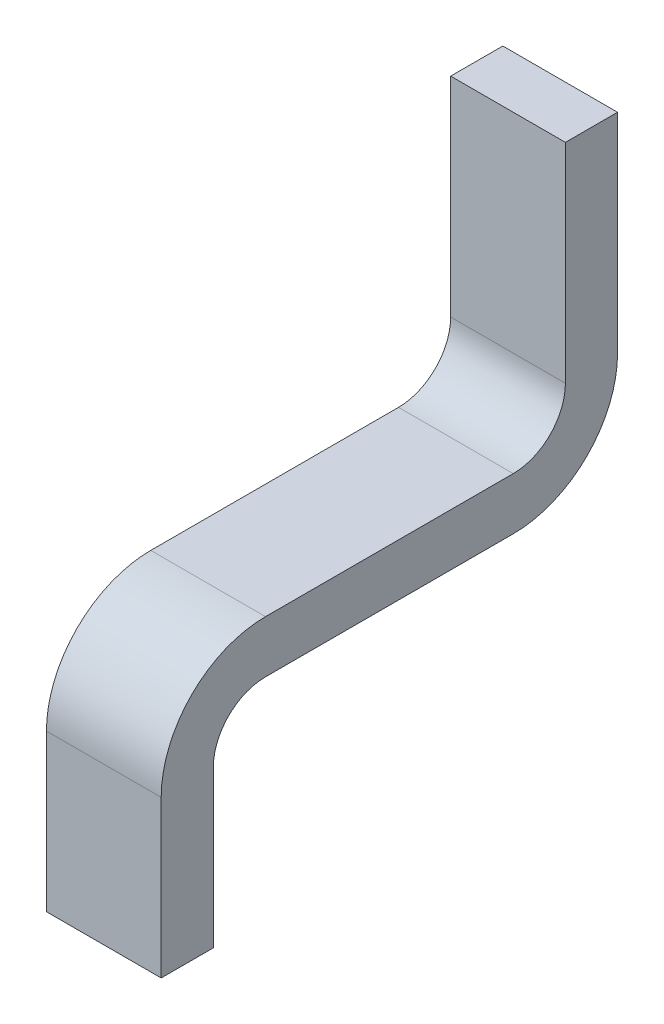
ISO-10303-21;
HEADER;
FILE_DESCRIPTION(('STEP AP214'),'2;1');
FILE_NAME('part.step','',(''),(''),'','','');
FILE_SCHEMA(('AUTOMOTIVE_DESIGN { 1 0 10303 214 1 1 1 1 }'));
ENDSEC;
DATA;
#1=APPLICATION_CONTEXT('core data for automotive mechanical design processes');
#2=APPLICATION_PROTOCOL_DEFINITION('international standard','automotive_design',2000,#1);
#3=PRODUCT_CONTEXT('',#1,'mechanical');
#4=PRODUCT('Part','Part','',(#3));
#5=PRODUCT_RELATED_PRODUCT_CATEGORY('part','',(#4));
#6=PRODUCT_DEFINITION_FORMATION('','',#4);
#7=PRODUCT_DEFINITION_CONTEXT('part definition',#1,'design');
#8=PRODUCT_DEFINITION('design','',#6,#7);
#9=PRODUCT_DEFINITION_SHAPE('','',#8);
#10=(LENGTH_UNIT() NAMED_UNIT(*) SI_UNIT(.MILLI.,.METRE.));
#11=(NAMED_UNIT(*) PLANE_ANGLE_UNIT() SI_UNIT($,.RADIAN.));
#12=(NAMED_UNIT(*) SI_UNIT($,.STERADIAN.) SOLID_ANGLE_UNIT());
#13=UNCERTAINTY_MEASURE_WITH_UNIT(LENGTH_MEASURE(1.E-05),#10,'distance_accuracy_value','');
#14=(GEOMETRIC_REPRESENTATION_CONTEXT(3) GLOBAL_UNCERTAINTY_ASSIGNED_CONTEXT((#13)) GLOBAL_UNIT_ASSIGNED_CONTEXT((#10,
#11,#12)) REPRESENTATION_CONTEXT('',''));
#15=CARTESIAN_POINT('',(0.,0.,0.));
#16=DIRECTION('',(0.,0.,1.));
#17=DIRECTION('',(1.,0.,0.));
#18=AXIS2_PLACEMENT_3D('',#15,#16,#17);
#19=CARTESIAN_POINT('',(-2.64,4.,0.675));
#20=DIRECTION('',(-1.,0.,0.));
#21=DIRECTION('',(0.,-1.,0.));
#22=AXIS2_PLACEMENT_3D('',#19,#20,#21);
#23=PLANE('',#22);
#24=CARTESIAN_POINT('',(-2.64000000000001,3.80000000000001,0.675));
#25=DIRECTION('',(1.,0.,0.));
#26=DIRECTION('',(0.,1.,0.));
#27=AXIS2_PLACEMENT_3D('',#24,#25,#26);
#28=CIRCLE('',#27,0.2);
#29=CARTESIAN_POINT('',(-2.64000000000001,3.80000000000001,0.875));
#30=VERTEX_POINT('',#29);
#31=CARTESIAN_POINT('',(-2.64,4.,0.675));
#32=VERTEX_POINT('',#31);
#33=EDGE_CURVE('E150',#30,#32,#28,.F.);
#34=ORIENTED_EDGE('',*,*,#33,.F.);
#35=DIRECTION('',(0.,1.,0.));
#36=VECTOR('',#35,1.);
#37=CARTESIAN_POINT('',(-2.64,3.5,0.875));
#38=LINE('',#37,#36);
#39=CARTESIAN_POINT('',(-2.64,3.5,0.875));
#40=VERTEX_POINT('',#39);
#41=EDGE_CURVE('E147',#30,#40,#38,.F.);
#42=ORIENTED_EDGE('',*,*,#41,.T.);
#43=DIRECTION('',(0.,0.,1.));
#44=VECTOR('',#43,1.);
#45=CARTESIAN_POINT('',(-2.64,3.5,0.775));
#46=LINE('',#45,#44);
#47=CARTESIAN_POINT('',(-2.64,3.5,0.775));
#48=VERTEX_POINT('',#47);
#49=EDGE_CURVE('E141',#48,#40,#46,.T.);
#50=ORIENTED_EDGE('',*,*,#49,.F.);
#51=DIRECTION('',(0.,1.,0.));
#52=VECTOR('',#51,1.);
#53=CARTESIAN_POINT('',(-2.64,3.5,0.775));
#54=LINE('',#53,#52);
#55=CARTESIAN_POINT('',(-2.64000000000001,3.80000000000001,0.775));
#56=VERTEX_POINT('',#55);
#57=EDGE_CURVE('E115',#48,#56,#54,.T.);
#58=ORIENTED_EDGE('',*,*,#57,.T.);
#59=CARTESIAN_POINT('',(-2.64000000000001,3.80000000000001,0.675));
#60=DIRECTION('',(1.,0.,0.));
#61=DIRECTION('',(0.,1.,0.));
#62=AXIS2_PLACEMENT_3D('',#59,#60,#61);
#63=CIRCLE('',#62,0.1);
#64=CARTESIAN_POINT('',(-2.64,3.9,0.675));
#65=VERTEX_POINT('',#64);
#66=EDGE_CURVE('E215',#56,#65,#63,.F.);
#67=ORIENTED_EDGE('',*,*,#66,.T.);
#68=DIRECTION('',(0.,0.,1.));
#69=VECTOR('',#68,1.);
#70=CARTESIAN_POINT('',(-2.64,3.9,0.675));
#71=LINE('',#70,#69);
#72=CARTESIAN_POINT('',(-2.64,3.9,0.2));
#73=VERTEX_POINT('',#72);
#74=EDGE_CURVE('E181',#65,#73,#71,.F.);
#75=ORIENTED_EDGE('',*,*,#74,.T.);
#76=CARTESIAN_POINT('',(-2.64,4.1,0.2));
#77=DIRECTION('',(-1.,0.,0.));
#78=DIRECTION('',(0.,-1.,0.));
#79=AXIS2_PLACEMENT_3D('',#76,#77,#78);
#80=CIRCLE('',#79,0.2);
#81=CARTESIAN_POINT('',(-2.64,4.1,0.));
#82=VERTEX_POINT('',#81);
#83=EDGE_CURVE('E20',#82,#73,#80,.T.);
#84=ORIENTED_EDGE('',*,*,#83,.F.);
#85=DIRECTION('',(0.,1.,0.));
#86=VECTOR('',#85,1.);
#87=CARTESIAN_POINT('',(-2.64,4.1,0.));
#88=LINE('',#87,#86);
#89=CARTESIAN_POINT('',(-2.64,4.5,0.));
#90=VERTEX_POINT('',#89);
#91=EDGE_CURVE('E91',#82,#90,#88,.T.);
#92=ORIENTED_EDGE('',*,*,#91,.T.);
#93=DIRECTION('',(0.,0.,1.));
#94=VECTOR('',#93,1.);
#95=CARTESIAN_POINT('',(-2.64,4.5,0.));
#96=LINE('',#95,#94);
#97=CARTESIAN_POINT('',(-2.64,4.5,0.1));
#98=VERTEX_POINT('',#97);
#99=EDGE_CURVE('E163',#90,#98,#96,.T.);
#100=ORIENTED_EDGE('',*,*,#99,.T.);
#101=DIRECTION('',(0.,1.,0.));
#102=VECTOR('',#101,1.);
#103=CARTESIAN_POINT('',(-2.64,4.1,0.1));
#104=LINE('',#103,#102);
#105=CARTESIAN_POINT('',(-2.64,4.1,0.1));
#106=VERTEX_POINT('',#105);
#107=EDGE_CURVE('E159',#98,#106,#104,.F.);
#108=ORIENTED_EDGE('',*,*,#107,.T.);
#109=CARTESIAN_POINT('',(-2.64,4.1,0.2));
#110=DIRECTION('',(-1.,0.,0.));
#111=DIRECTION('',(0.,-1.,0.));
#112=AXIS2_PLACEMENT_3D('',#109,#110,#111);
#113=CIRCLE('',#112,0.1);
#114=CARTESIAN_POINT('',(-2.64,4.,0.2));
#115=VERTEX_POINT('',#114);
#116=EDGE_CURVE('E155',#106,#115,#113,.T.);
#117=ORIENTED_EDGE('',*,*,#116,.T.);
#118=DIRECTION('',(0.,0.,1.));
#119=VECTOR('',#118,1.);
#120=CARTESIAN_POINT('',(-2.64,4.,0.675));
#121=LINE('',#120,#119);
#122=EDGE_CURVE('E154',#115,#32,#121,.T.);
#123=ORIENTED_EDGE('',*,*,#122,.T.);
#124=EDGE_LOOP('',(#34,#42,#50,#58,#67,#75,#84,#92,#100,#108,#117,#123));
#125=FACE_BOUND('',#124,.T.);
#126=ADVANCED_FACE('F17',(#125),#23,.F.);
#127=CARTESIAN_POINT('',(-2.64,4.1,0.2));
#128=DIRECTION('',(-1.,0.,0.));
#129=DIRECTION('',(0.,-1.,0.));
#130=AXIS2_PLACEMENT_3D('',#127,#128,#129);
#131=CYLINDRICAL_SURFACE('',#130,0.2);
#132=CARTESIAN_POINT('',(-2.86,4.1,0.2));
#133=DIRECTION('',(-1.,0.,0.));
#134=DIRECTION('',(0.,-1.,0.));
#135=AXIS2_PLACEMENT_3D('',#132,#133,#134);
#136=CIRCLE('',#135,0.2);
#137=CARTESIAN_POINT('',(-2.86,3.9,0.2));
#138=VERTEX_POINT('',#137);
#139=CARTESIAN_POINT('',(-2.86,4.1,0.));
#140=VERTEX_POINT('',#139);
#141=EDGE_CURVE('E183',#138,#140,#136,.F.);
#142=ORIENTED_EDGE('',*,*,#141,.T.);
#143=DIRECTION('',(1.,0.,0.));
#144=VECTOR('',#143,1.);
#145=CARTESIAN_POINT('',(-2.64,4.1,0.));
#146=LINE('',#145,#144);
#147=EDGE_CURVE('E178',#140,#82,#146,.T.);
#148=ORIENTED_EDGE('',*,*,#147,.T.);
#149=ORIENTED_EDGE('',*,*,#83,.T.);
#150=DIRECTION('',(-1.,0.,0.));
#151=VECTOR('',#150,1.);
#152=CARTESIAN_POINT('',(-2.64,3.9,0.2));
#153=LINE('',#152,#151);
#154=EDGE_CURVE('E217',#73,#138,#153,.T.);
#155=ORIENTED_EDGE('',*,*,#154,.T.);
#156=EDGE_LOOP('',(#142,#148,#149,#155));
#157=FACE_BOUND('',#156,.T.);
#158=ADVANCED_FACE('F254',(#157),#131,.T.);
#159=CARTESIAN_POINT('',(-2.64,4.1,0.));
#160=DIRECTION('',(0.,0.,1.));
#161=DIRECTION('',(1.,0.,0.));
#162=AXIS2_PLACEMENT_3D('',#159,#160,#161);
#163=PLANE('',#162);
#164=ORIENTED_EDGE('',*,*,#147,.F.);
#165=DIRECTION('',(0.,1.,0.));
#166=VECTOR('',#165,1.);
#167=CARTESIAN_POINT('',(-2.86,3.9,0.));
#168=LINE('',#167,#166);
#169=CARTESIAN_POINT('',(-2.86,4.5,0.));
#170=VERTEX_POINT('',#169);
#171=EDGE_CURVE('E170',#140,#170,#168,.T.);
#172=ORIENTED_EDGE('',*,*,#171,.T.);
#173=DIRECTION('',(1.,0.,0.));
#174=VECTOR('',#173,1.);
#175=CARTESIAN_POINT('',(-2.64,4.5,0.));
#176=LINE('',#175,#174);
#177=EDGE_CURVE('E173',#170,#90,#176,.T.);
#178=ORIENTED_EDGE('',*,*,#177,.T.);
#179=ORIENTED_EDGE('',*,*,#91,.F.);
#180=EDGE_LOOP('',(#164,#172,#178,#179));
#181=FACE_BOUND('',#180,.T.);
#182=ADVANCED_FACE('F257',(#181),#163,.F.);
#183=CARTESIAN_POINT('',(-2.64,4.5,0.));
#184=DIRECTION('',(0.,-1.,0.));
#185=DIRECTION('',(1.,0.,0.));
#186=AXIS2_PLACEMENT_3D('',#183,#184,#185);
#187=PLANE('',#186);
#188=DIRECTION('',(-1.,0.,0.));
#189=VECTOR('',#188,1.);
#190=CARTESIAN_POINT('',(-2.86,4.5,0.1));
#191=LINE('',#190,#189);
#192=CARTESIAN_POINT('',(-2.86,4.5,0.1));
#193=VERTEX_POINT('',#192);
#194=EDGE_CURVE('E160',#193,#98,#191,.F.);
#195=ORIENTED_EDGE('',*,*,#194,.T.);
#196=ORIENTED_EDGE('',*,*,#99,.F.);
#197=ORIENTED_EDGE('',*,*,#177,.F.);
#198=DIRECTION('',(0.,0.,1.));
#199=VECTOR('',#198,1.);
#200=CARTESIAN_POINT('',(-2.86,4.5,0.675));
#201=LINE('',#200,#199);
#202=EDGE_CURVE('E166',#170,#193,#201,.T.);
#203=ORIENTED_EDGE('',*,*,#202,.T.);
#204=EDGE_LOOP('',(#195,#196,#197,#203));
#205=FACE_BOUND('',#204,.T.);
#206=ADVANCED_FACE('F259',(#205),#187,.F.);
#207=CARTESIAN_POINT('',(-2.86,4.1,0.1));
#208=DIRECTION('',(0.,0.,-1.));
#209=DIRECTION('',(-1.,0.,0.));
#210=AXIS2_PLACEMENT_3D('',#207,#208,#209);
#211=PLANE('',#210);
#212=DIRECTION('',(-1.,0.,0.));
#213=VECTOR('',#212,1.);
#214=CARTESIAN_POINT('',(-2.86,4.1,0.1));
#215=LINE('',#214,#213);
#216=CARTESIAN_POINT('',(-2.86,4.1,0.1));
#217=VERTEX_POINT('',#216);
#218=EDGE_CURVE('E156',#217,#106,#215,.F.);
#219=ORIENTED_EDGE('',*,*,#218,.T.);
#220=ORIENTED_EDGE('',*,*,#107,.F.);
#221=ORIENTED_EDGE('',*,*,#194,.F.);
#222=DIRECTION('',(0.,1.,0.));
#223=VECTOR('',#222,1.);
#224=CARTESIAN_POINT('',(-2.86,3.9,0.1));
#225=LINE('',#224,#223);
#226=EDGE_CURVE('E169',#193,#217,#225,.F.);
#227=ORIENTED_EDGE('',*,*,#226,.T.);
#228=EDGE_LOOP('',(#219,#220,#221,#227));
#229=FACE_BOUND('',#228,.T.);
#230=ADVANCED_FACE('F234',(#229),#211,.F.);
#231=CARTESIAN_POINT('',(-2.86,4.1,0.2));
#232=DIRECTION('',(-1.,0.,0.));
#233=DIRECTION('',(0.,-1.,0.));
#234=AXIS2_PLACEMENT_3D('',#231,#232,#233);
#235=CYLINDRICAL_SURFACE('',#234,0.1);
#236=DIRECTION('',(1.,0.,0.));
#237=VECTOR('',#236,1.);
#238=CARTESIAN_POINT('',(-2.86,4.,0.2));
#239=LINE('',#238,#237);
#240=CARTESIAN_POINT('',(-2.86,4.,0.2));
#241=VERTEX_POINT('',#240);
#242=EDGE_CURVE('E151',#241,#115,#239,.T.);
#243=ORIENTED_EDGE('',*,*,#242,.T.);
#244=ORIENTED_EDGE('',*,*,#116,.F.);
#245=ORIENTED_EDGE('',*,*,#218,.F.);
#246=CARTESIAN_POINT('',(-2.86,4.1,0.2));
#247=DIRECTION('',(-1.,0.,0.));
#248=DIRECTION('',(0.,-1.,0.));
#249=AXIS2_PLACEMENT_3D('',#246,#247,#248);
#250=CIRCLE('',#249,0.1);
#251=EDGE_CURVE('E210',#217,#241,#250,.T.);
#252=ORIENTED_EDGE('',*,*,#251,.T.);
#253=EDGE_LOOP('',(#243,#244,#245,#252));
#254=FACE_BOUND('',#253,.T.);
#255=ADVANCED_FACE('F227',(#254),#235,.F.);
#256=CARTESIAN_POINT('',(-2.86,4.,0.675));
#257=DIRECTION('',(0.,-1.,0.));
#258=DIRECTION('',(1.,0.,0.));
#259=AXIS2_PLACEMENT_3D('',#256,#257,#258);
#260=PLANE('',#259);
#261=DIRECTION('',(1.,0.,0.));
#262=VECTOR('',#261,1.);
#263=CARTESIAN_POINT('',(-2.86,4.,0.675));
#264=LINE('',#263,#262);
#265=CARTESIAN_POINT('',(-2.86,4.,0.675));
#266=VERTEX_POINT('',#265);
#267=EDGE_CURVE('E148',#32,#266,#264,.F.);
#268=ORIENTED_EDGE('',*,*,#267,.F.);
#269=ORIENTED_EDGE('',*,*,#122,.F.);
#270=ORIENTED_EDGE('',*,*,#242,.F.);
#271=DIRECTION('',(0.,0.,1.));
#272=VECTOR('',#271,1.);
#273=CARTESIAN_POINT('',(-2.86,4.,0.675));
#274=LINE('',#273,#272);
#275=EDGE_CURVE('E209',#241,#266,#274,.T.);
#276=ORIENTED_EDGE('',*,*,#275,.T.);
#277=EDGE_LOOP('',(#268,#269,#270,#276));
#278=FACE_BOUND('',#277,.T.);
#279=ADVANCED_FACE('F224',(#278),#260,.F.);
#280=CARTESIAN_POINT('',(-2.86,3.8,0.675));
#281=DIRECTION('',(1.,0.,0.));
#282=DIRECTION('',(0.,1.,0.));
#283=AXIS2_PLACEMENT_3D('',#280,#281,#282);
#284=CYLINDRICAL_SURFACE('',#283,0.2);
#285=ORIENTED_EDGE('',*,*,#33,.T.);
#286=ORIENTED_EDGE('',*,*,#267,.T.);
#287=CARTESIAN_POINT('',(-2.86,3.8,0.675));
#288=DIRECTION('',(1.,0.,0.));
#289=DIRECTION('',(0.,1.,0.));
#290=AXIS2_PLACEMENT_3D('',#287,#288,#289);
#291=CIRCLE('',#290,0.2);
#292=CARTESIAN_POINT('',(-2.86,3.8,0.875));
#293=VERTEX_POINT('',#292);
#294=EDGE_CURVE('E133',#266,#293,#291,.T.);
#295=ORIENTED_EDGE('',*,*,#294,.T.);
#296=DIRECTION('',(-1.,0.,0.));
#297=VECTOR('',#296,1.);
#298=CARTESIAN_POINT('',(-2.86,3.8,0.875));
#299=LINE('',#298,#297);
#300=EDGE_CURVE('E144',#293,#30,#299,.F.);
#301=ORIENTED_EDGE('',*,*,#300,.T.);
#302=EDGE_LOOP('',(#285,#286,#295,#301));
#303=FACE_BOUND('',#302,.T.);
#304=ADVANCED_FACE('F285',(#303),#284,.T.);
#305=CARTESIAN_POINT('',(-2.86,3.5,0.875));
#306=DIRECTION('',(0.,0.,-1.));
#307=DIRECTION('',(-1.,0.,0.));
#308=AXIS2_PLACEMENT_3D('',#305,#306,#307);
#309=PLANE('',#308);
#310=DIRECTION('',(1.,0.,0.));
#311=VECTOR('',#310,1.);
#312=CARTESIAN_POINT('',(-2.64,3.5,0.875));
#313=LINE('',#312,#311);
#314=CARTESIAN_POINT('',(-2.86,3.5,0.875));
#315=VERTEX_POINT('',#314);
#316=EDGE_CURVE('E118',#40,#315,#313,.F.);
#317=ORIENTED_EDGE('',*,*,#316,.F.);
#318=ORIENTED_EDGE('',*,*,#41,.F.);
#319=ORIENTED_EDGE('',*,*,#300,.F.);
#320=DIRECTION('',(0.,1.,0.));
#321=VECTOR('',#320,1.);
#322=CARTESIAN_POINT('',(-2.86,3.9,0.875));
#323=LINE('',#322,#321);
#324=EDGE_CURVE('E131',#293,#315,#323,.F.);
#325=ORIENTED_EDGE('',*,*,#324,.T.);
#326=EDGE_LOOP('',(#317,#318,#319,#325));
#327=FACE_BOUND('',#326,.T.);
#328=ADVANCED_FACE('F282',(#327),#309,.F.);
#329=CARTESIAN_POINT('',(-2.64,3.5,0.775));
#330=DIRECTION('',(0.,-1.,0.));
#331=DIRECTION('',(1.,0.,0.));
#332=AXIS2_PLACEMENT_3D('',#329,#330,#331);
#333=PLANE('',#332);
#334=ORIENTED_EDGE('',*,*,#49,.T.);
#335=ORIENTED_EDGE('',*,*,#316,.T.);
#336=DIRECTION('',(0.,0.,1.));
#337=VECTOR('',#336,1.);
#338=CARTESIAN_POINT('',(-2.86,3.5,0.675));
#339=LINE('',#338,#337);
#340=CARTESIAN_POINT('',(-2.86,3.5,0.775));
#341=VERTEX_POINT('',#340);
#342=EDGE_CURVE('E125',#315,#341,#339,.F.);
#343=ORIENTED_EDGE('',*,*,#342,.T.);
#344=DIRECTION('',(1.,0.,0.));
#345=VECTOR('',#344,1.);
#346=CARTESIAN_POINT('',(-2.64,3.5,0.775));
#347=LINE('',#346,#345);
#348=EDGE_CURVE('E110',#341,#48,#347,.T.);
#349=ORIENTED_EDGE('',*,*,#348,.T.);
#350=EDGE_LOOP('',(#334,#335,#343,#349));
#351=FACE_BOUND('',#350,.T.);
#352=ADVANCED_FACE('F129',(#351),#333,.T.);
#353=CARTESIAN_POINT('',(-2.64,3.5,0.775));
#354=DIRECTION('',(0.,0.,1.));
#355=DIRECTION('',(1.,0.,0.));
#356=AXIS2_PLACEMENT_3D('',#353,#354,#355);
#357=PLANE('',#356);
#358=ORIENTED_EDGE('',*,*,#348,.F.);
#359=DIRECTION('',(0.,1.,0.));
#360=VECTOR('',#359,1.);
#361=CARTESIAN_POINT('',(-2.86,3.9,0.775));
#362=LINE('',#361,#360);
#363=CARTESIAN_POINT('',(-2.86,3.8,0.775));
#364=VERTEX_POINT('',#363);
#365=EDGE_CURVE('E114',#341,#364,#362,.T.);
#366=ORIENTED_EDGE('',*,*,#365,.T.);
#367=DIRECTION('',(1.,0.,0.));
#368=VECTOR('',#367,1.);
#369=CARTESIAN_POINT('',(-2.64000000000001,3.80000000000001,0.775));
#370=LINE('',#369,#368);
#371=EDGE_CURVE('E185',#364,#56,#370,.T.);
#372=ORIENTED_EDGE('',*,*,#371,.T.);
#373=ORIENTED_EDGE('',*,*,#57,.F.);
#374=EDGE_LOOP('',(#358,#366,#372,#373));
#375=FACE_BOUND('',#374,.T.);
#376=ADVANCED_FACE('F112',(#375),#357,.F.);
#377=CARTESIAN_POINT('',(-2.64000000000001,3.80000000000001,0.675));
#378=DIRECTION('',(1.,0.,0.));
#379=DIRECTION('',(0.,1.,0.));
#380=AXIS2_PLACEMENT_3D('',#377,#378,#379);
#381=CYLINDRICAL_SURFACE('',#380,0.1);
#382=ORIENTED_EDGE('',*,*,#371,.F.);
#383=CARTESIAN_POINT('',(-2.86,3.8,0.675));
#384=DIRECTION('',(1.,0.,0.));
#385=DIRECTION('',(0.,1.,0.));
#386=AXIS2_PLACEMENT_3D('',#383,#384,#385);
#387=CIRCLE('',#386,0.1);
#388=CARTESIAN_POINT('',(-2.86,3.9,0.675));
#389=VERTEX_POINT('',#388);
#390=EDGE_CURVE('E26',#364,#389,#387,.F.);
#391=ORIENTED_EDGE('',*,*,#390,.T.);
#392=DIRECTION('',(-1.,0.,0.));
#393=VECTOR('',#392,1.);
#394=CARTESIAN_POINT('',(-2.64,3.9,0.675));
#395=LINE('',#394,#393);
#396=EDGE_CURVE('E34',#389,#65,#395,.F.);
#397=ORIENTED_EDGE('',*,*,#396,.T.);
#398=ORIENTED_EDGE('',*,*,#66,.F.);
#399=EDGE_LOOP('',(#382,#391,#397,#398));
#400=FACE_BOUND('',#399,.T.);
#401=ADVANCED_FACE('F250',(#400),#381,.F.);
#402=CARTESIAN_POINT('',(-2.64,3.9,0.675));
#403=DIRECTION('',(0.,1.,0.));
#404=DIRECTION('',(-1.,0.,0.));
#405=AXIS2_PLACEMENT_3D('',#402,#403,#404);
#406=PLANE('',#405);
#407=ORIENTED_EDGE('',*,*,#396,.F.);
#408=DIRECTION('',(0.,0.,1.));
#409=VECTOR('',#408,1.);
#410=CARTESIAN_POINT('',(-2.86,3.9,0.675));
#411=LINE('',#410,#409);
#412=EDGE_CURVE('E11',#389,#138,#411,.F.);
#413=ORIENTED_EDGE('',*,*,#412,.T.);
#414=ORIENTED_EDGE('',*,*,#154,.F.);
#415=ORIENTED_EDGE('',*,*,#74,.F.);
#416=EDGE_LOOP('',(#407,#413,#414,#415));
#417=FACE_BOUND('',#416,.T.);
#418=ADVANCED_FACE('F252',(#417),#406,.F.);
#419=CARTESIAN_POINT('',(-2.86,3.9,0.675));
#420=DIRECTION('',(1.,0.,0.));
#421=DIRECTION('',(0.,1.,0.));
#422=AXIS2_PLACEMENT_3D('',#419,#420,#421);
#423=PLANE('',#422);
#424=ORIENTED_EDGE('',*,*,#390,.F.);
#425=ORIENTED_EDGE('',*,*,#365,.F.);
#426=ORIENTED_EDGE('',*,*,#342,.F.);
#427=ORIENTED_EDGE('',*,*,#324,.F.);
#428=ORIENTED_EDGE('',*,*,#294,.F.);
#429=ORIENTED_EDGE('',*,*,#275,.F.);
#430=ORIENTED_EDGE('',*,*,#251,.F.);
#431=ORIENTED_EDGE('',*,*,#226,.F.);
#432=ORIENTED_EDGE('',*,*,#202,.F.);
#433=ORIENTED_EDGE('',*,*,#171,.F.);
#434=ORIENTED_EDGE('',*,*,#141,.F.);
#435=ORIENTED_EDGE('',*,*,#412,.F.);
#436=EDGE_LOOP('',(#424,#425,#426,#427,#428,#429,#430,#431,#432,#433,#434,#435));
#437=FACE_BOUND('',#436,.T.);
#438=ADVANCED_FACE('F123',(#437),#423,.F.);
#439=CLOSED_SHELL('',(#126,#158,#182,#206,#230,#255,#279,#304,#328,#352,#376,#401,#418,#438));
#440=MANIFOLD_SOLID_BREP('B1',#439);
#441=ADVANCED_BREP_SHAPE_REPRESENTATION('',(#18,#440),#14);
#442=SHAPE_DEFINITION_REPRESENTATION(#9,#441);
ENDSEC;
END-ISO-10303-21;
